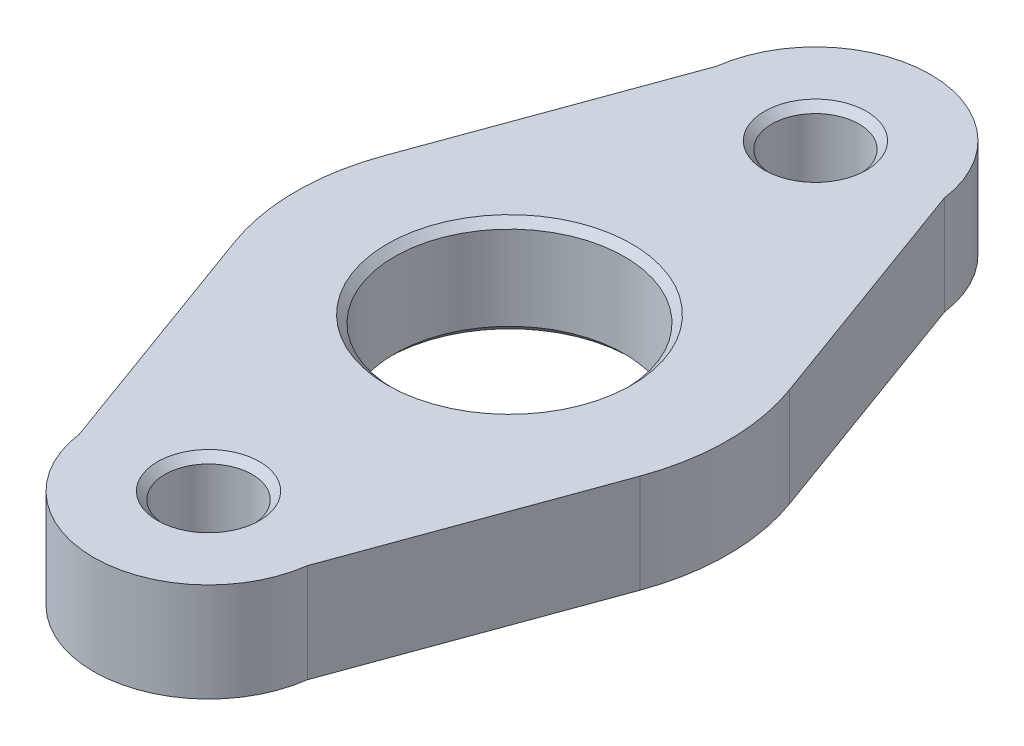
ISO-10303-21;
HEADER;
FILE_DESCRIPTION(('STEP AP214'),'2;1');
FILE_NAME('part.step','',(''),(''),'','','');
FILE_SCHEMA(('AUTOMOTIVE_DESIGN { 1 0 10303 214 1 1 1 1 }'));
ENDSEC;
DATA;
#1=APPLICATION_CONTEXT('core data for automotive mechanical design processes');
#2=APPLICATION_PROTOCOL_DEFINITION('international standard','automotive_design',2000,#1);
#3=PRODUCT_CONTEXT('',#1,'mechanical');
#4=PRODUCT('Part','Part','',(#3));
#5=PRODUCT_RELATED_PRODUCT_CATEGORY('part','',(#4));
#6=PRODUCT_DEFINITION_FORMATION('','',#4);
#7=PRODUCT_DEFINITION_CONTEXT('part definition',#1,'design');
#8=PRODUCT_DEFINITION('design','',#6,#7);
#9=PRODUCT_DEFINITION_SHAPE('','',#8);
#10=(LENGTH_UNIT() NAMED_UNIT(*) SI_UNIT(.MILLI.,.METRE.));
#11=(NAMED_UNIT(*) PLANE_ANGLE_UNIT() SI_UNIT($,.RADIAN.));
#12=(NAMED_UNIT(*) SI_UNIT($,.STERADIAN.) SOLID_ANGLE_UNIT());
#13=UNCERTAINTY_MEASURE_WITH_UNIT(LENGTH_MEASURE(1.E-05),#10,'distance_accuracy_value','');
#14=(GEOMETRIC_REPRESENTATION_CONTEXT(3) GLOBAL_UNCERTAINTY_ASSIGNED_CONTEXT((#13)) GLOBAL_UNIT_ASSIGNED_CONTEXT((#10,
#11,#12)) REPRESENTATION_CONTEXT('',''));
#15=CARTESIAN_POINT('',(0.,0.,0.));
#16=DIRECTION('',(0.,0.,1.));
#17=DIRECTION('',(1.,0.,0.));
#18=AXIS2_PLACEMENT_3D('',#15,#16,#17);
#19=CARTESIAN_POINT('',(95.6079158511101,80.772,0.));
#20=DIRECTION('',(0.,1.,0.));
#21=DIRECTION('',(0.,0.,1.));
#22=AXIS2_PLACEMENT_3D('',#19,#20,#21);
#23=PLANE('',#22);
#24=CARTESIAN_POINT('',(95.885,80.772,33.528));
#25=DIRECTION('',(0.,1.,0.));
#26=DIRECTION('',(0.,0.,1.));
#27=AXIS2_PLACEMENT_3D('',#24,#25,#26);
#28=CIRCLE('',#27,5.63879999999997);
#29=CARTESIAN_POINT('',(95.885,80.772,39.1668));
#30=VERTEX_POINT('',#29);
#31=EDGE_CURVE('E209',#30,#30,#28,.F.);
#32=ORIENTED_EDGE('',*,*,#31,.T.);
#33=EDGE_LOOP('',(#32));
#34=FACE_BOUND('',#33,.T.);
#35=CARTESIAN_POINT('',(95.885,80.772,-33.528));
#36=DIRECTION('',(0.,1.,0.));
#37=DIRECTION('',(0.,0.,1.));
#38=AXIS2_PLACEMENT_3D('',#35,#36,#37);
#39=CIRCLE('',#38,5.6388);
#40=CARTESIAN_POINT('',(95.885,80.772,-27.8892));
#41=VERTEX_POINT('',#40);
#42=EDGE_CURVE('E206',#41,#41,#39,.F.);
#43=ORIENTED_EDGE('',*,*,#42,.T.);
#44=EDGE_LOOP('',(#43));
#45=FACE_BOUND('',#44,.T.);
#46=CARTESIAN_POINT('',(95.6079158511101,80.772,0.));
#47=DIRECTION('',(0.,1.,0.));
#48=DIRECTION('',(0.,0.,1.));
#49=AXIS2_PLACEMENT_3D('',#46,#47,#48);
#50=CIRCLE('',#49,13.5128);
#51=CARTESIAN_POINT('',(95.6079158511101,80.772,13.5128));
#52=VERTEX_POINT('',#51);
#53=EDGE_CURVE('E203',#52,#52,#50,.F.);
#54=ORIENTED_EDGE('',*,*,#53,.T.);
#55=EDGE_LOOP('',(#54));
#56=FACE_BOUND('',#55,.T.);
#57=CARTESIAN_POINT('',(95.6079158511101,80.772,0.));
#58=DIRECTION('',(0.,1.,0.));
#59=DIRECTION('',(0.,0.,1.));
#60=AXIS2_PLACEMENT_3D('',#57,#58,#59);
#61=CIRCLE('',#60,24.13);
#62=CARTESIAN_POINT('',(118.282698790674,80.772,8.25294605844834));
#63=VERTEX_POINT('',#62);
#64=CARTESIAN_POINT('',(118.282698790674,80.772,-8.25294605844833));
#65=VERTEX_POINT('',#64);
#66=EDGE_CURVE('E173',#63,#65,#61,.T.);
#67=ORIENTED_EDGE('',*,*,#66,.T.);
#68=DIRECTION('',(-0.342020143325663,0.,-0.939692620785911));
#69=VECTOR('',#68,1.);
#70=CARTESIAN_POINT('',(118.282698790674,80.772,-8.25294605844833));
#71=LINE('',#70,#69);
#72=CARTESIAN_POINT('',(108.474274458966,80.772,-35.2013704302452));
#73=VERTEX_POINT('',#72);
#74=EDGE_CURVE('E123',#65,#73,#71,.T.);
#75=ORIENTED_EDGE('',*,*,#74,.T.);
#76=CARTESIAN_POINT('',(95.885,80.772,-33.528));
#77=DIRECTION('',(0.,1.,0.));
#78=DIRECTION('',(0.,0.,1.));
#79=AXIS2_PLACEMENT_3D('',#76,#77,#78);
#80=CIRCLE('',#79,12.7);
#81=CARTESIAN_POINT('',(83.2957255410337,80.772,-35.2013704302452));
#82=VERTEX_POINT('',#81);
#83=EDGE_CURVE('E314',#73,#82,#80,.T.);
#84=ORIENTED_EDGE('',*,*,#83,.T.);
#85=DIRECTION('',(-0.342020143325663,0.,0.93969262078591));
#86=VECTOR('',#85,1.);
#87=CARTESIAN_POINT('',(83.2957255410337,80.772,-35.2013704302452));
#88=LINE('',#87,#86);
#89=CARTESIAN_POINT('',(73.4873012093259,80.772,-8.25294605844835));
#90=VERTEX_POINT('',#89);
#91=EDGE_CURVE('E318',#82,#90,#88,.T.);
#92=ORIENTED_EDGE('',*,*,#91,.T.);
#93=CARTESIAN_POINT('',(96.1620841488899,80.772,0.));
#94=DIRECTION('',(0.,1.,0.));
#95=DIRECTION('',(0.,0.,1.));
#96=AXIS2_PLACEMENT_3D('',#93,#94,#95);
#97=CIRCLE('',#96,24.13);
#98=CARTESIAN_POINT('',(73.4873012093259,80.772,8.25294605844834));
#99=VERTEX_POINT('',#98);
#100=EDGE_CURVE('E141',#90,#99,#97,.T.);
#101=ORIENTED_EDGE('',*,*,#100,.T.);
#102=DIRECTION('',(0.342020143325663,0.,0.93969262078591));
#103=VECTOR('',#102,1.);
#104=CARTESIAN_POINT('',(73.4873012093259,80.772,8.25294605844834));
#105=LINE('',#104,#103);
#106=CARTESIAN_POINT('',(83.2957255410337,80.772,35.2013704302452));
#107=VERTEX_POINT('',#106);
#108=EDGE_CURVE('E136',#99,#107,#105,.T.);
#109=ORIENTED_EDGE('',*,*,#108,.T.);
#110=CARTESIAN_POINT('',(95.885,80.772,33.528));
#111=DIRECTION('',(0.,1.,0.));
#112=DIRECTION('',(0.,0.,1.));
#113=AXIS2_PLACEMENT_3D('',#110,#111,#112);
#114=CIRCLE('',#113,12.7);
#115=CARTESIAN_POINT('',(108.474274458966,80.772,35.2013704302452));
#116=VERTEX_POINT('',#115);
#117=EDGE_CURVE('E139',#107,#116,#114,.T.);
#118=ORIENTED_EDGE('',*,*,#117,.T.);
#119=DIRECTION('',(0.342020143325663,0.,-0.939692620785911));
#120=VECTOR('',#119,1.);
#121=CARTESIAN_POINT('',(108.474274458966,80.772,35.2013704302452));
#122=LINE('',#121,#120);
#123=EDGE_CURVE('E79',#116,#63,#122,.T.);
#124=ORIENTED_EDGE('',*,*,#123,.T.);
#125=EDGE_LOOP('',(#67,#75,#84,#92,#101,#109,#118,#124));
#126=FACE_BOUND('',#125,.T.);
#127=ADVANCED_FACE('F62',(#34,#45,#56,#126),#23,.T.);
#128=CARTESIAN_POINT('',(95.6079158511101,69.85,0.));
#129=DIRECTION('',(0.,1.,0.));
#130=DIRECTION('',(0.,0.,1.));
#131=AXIS2_PLACEMENT_3D('',#128,#129,#130);
#132=PLANE('',#131);
#133=CARTESIAN_POINT('',(95.885,69.85,33.528));
#134=DIRECTION('',(0.,1.,0.));
#135=DIRECTION('',(0.,0.,1.));
#136=AXIS2_PLACEMENT_3D('',#133,#134,#135);
#137=CIRCLE('',#136,5.63879999999999);
#138=CARTESIAN_POINT('',(95.885,69.85,39.1668));
#139=VERTEX_POINT('',#138);
#140=EDGE_CURVE('E194',#139,#139,#137,.T.);
#141=ORIENTED_EDGE('',*,*,#140,.T.);
#142=EDGE_LOOP('',(#141));
#143=FACE_BOUND('',#142,.T.);
#144=CARTESIAN_POINT('',(95.885,69.85,-33.528));
#145=DIRECTION('',(0.,1.,0.));
#146=DIRECTION('',(0.,0.,1.));
#147=AXIS2_PLACEMENT_3D('',#144,#145,#146);
#148=CIRCLE('',#147,5.63879999999997);
#149=CARTESIAN_POINT('',(95.885,69.85,-27.8892));
#150=VERTEX_POINT('',#149);
#151=EDGE_CURVE('E191',#150,#150,#148,.T.);
#152=ORIENTED_EDGE('',*,*,#151,.T.);
#153=EDGE_LOOP('',(#152));
#154=FACE_BOUND('',#153,.T.);
#155=CARTESIAN_POINT('',(95.6079158511101,69.85,0.));
#156=DIRECTION('',(0.,1.,0.));
#157=DIRECTION('',(0.,0.,1.));
#158=AXIS2_PLACEMENT_3D('',#155,#156,#157);
#159=CIRCLE('',#158,13.5128);
#160=CARTESIAN_POINT('',(95.6079158511101,69.85,13.5128));
#161=VERTEX_POINT('',#160);
#162=EDGE_CURVE('E188',#161,#161,#159,.T.);
#163=ORIENTED_EDGE('',*,*,#162,.T.);
#164=EDGE_LOOP('',(#163));
#165=FACE_BOUND('',#164,.T.);
#166=CARTESIAN_POINT('',(95.6079158511101,69.85,0.));
#167=DIRECTION('',(0.,1.,0.));
#168=DIRECTION('',(0.,0.,1.));
#169=AXIS2_PLACEMENT_3D('',#166,#167,#168);
#170=CIRCLE('',#169,24.13);
#171=CARTESIAN_POINT('',(118.282698790674,69.85,8.25294605844834));
#172=VERTEX_POINT('',#171);
#173=CARTESIAN_POINT('',(118.282698790674,69.85,-8.25294605844833));
#174=VERTEX_POINT('',#173);
#175=EDGE_CURVE('E159',#172,#174,#170,.T.);
#176=ORIENTED_EDGE('',*,*,#175,.F.);
#177=DIRECTION('',(0.342020143325663,0.,-0.939692620785911));
#178=VECTOR('',#177,1.);
#179=CARTESIAN_POINT('',(108.474274458966,69.85,35.2013704302452));
#180=LINE('',#179,#178);
#181=CARTESIAN_POINT('',(108.474274458966,69.85,35.2013704302452));
#182=VERTEX_POINT('',#181);
#183=EDGE_CURVE('E114',#182,#172,#180,.T.);
#184=ORIENTED_EDGE('',*,*,#183,.F.);
#185=CARTESIAN_POINT('',(95.885,69.85,33.528));
#186=DIRECTION('',(0.,1.,0.));
#187=DIRECTION('',(0.,0.,1.));
#188=AXIS2_PLACEMENT_3D('',#185,#186,#187);
#189=CIRCLE('',#188,12.7);
#190=CARTESIAN_POINT('',(83.2957255410337,69.85,35.2013704302452));
#191=VERTEX_POINT('',#190);
#192=EDGE_CURVE('E108',#191,#182,#189,.T.);
#193=ORIENTED_EDGE('',*,*,#192,.F.);
#194=DIRECTION('',(0.342020143325663,0.,0.93969262078591));
#195=VECTOR('',#194,1.);
#196=CARTESIAN_POINT('',(73.4873012093259,69.85,8.25294605844834));
#197=LINE('',#196,#195);
#198=CARTESIAN_POINT('',(73.4873012093259,69.85,8.25294605844834));
#199=VERTEX_POINT('',#198);
#200=EDGE_CURVE('E149',#199,#191,#197,.T.);
#201=ORIENTED_EDGE('',*,*,#200,.F.);
#202=CARTESIAN_POINT('',(96.1620841488899,69.85,0.));
#203=DIRECTION('',(0.,1.,0.));
#204=DIRECTION('',(0.,0.,1.));
#205=AXIS2_PLACEMENT_3D('',#202,#203,#204);
#206=CIRCLE('',#205,24.13);
#207=CARTESIAN_POINT('',(73.4873012093259,69.85,-8.25294605844835));
#208=VERTEX_POINT('',#207);
#209=EDGE_CURVE('E168',#208,#199,#206,.T.);
#210=ORIENTED_EDGE('',*,*,#209,.F.);
#211=DIRECTION('',(-0.342020143325663,0.,0.93969262078591));
#212=VECTOR('',#211,1.);
#213=CARTESIAN_POINT('',(83.2957255410337,69.85,-35.2013704302452));
#214=LINE('',#213,#212);
#215=CARTESIAN_POINT('',(83.2957255410337,69.85,-35.2013704302452));
#216=VERTEX_POINT('',#215);
#217=EDGE_CURVE('E166',#216,#208,#214,.T.);
#218=ORIENTED_EDGE('',*,*,#217,.F.);
#219=CARTESIAN_POINT('',(95.885,69.85,-33.528));
#220=DIRECTION('',(0.,1.,0.));
#221=DIRECTION('',(0.,0.,1.));
#222=AXIS2_PLACEMENT_3D('',#219,#220,#221);
#223=CIRCLE('',#222,12.7);
#224=CARTESIAN_POINT('',(108.474274458966,69.85,-35.2013704302452));
#225=VERTEX_POINT('',#224);
#226=EDGE_CURVE('E164',#225,#216,#223,.T.);
#227=ORIENTED_EDGE('',*,*,#226,.F.);
#228=DIRECTION('',(-0.342020143325663,0.,-0.939692620785911));
#229=VECTOR('',#228,1.);
#230=CARTESIAN_POINT('',(118.282698790674,69.85,-8.25294605844833));
#231=LINE('',#230,#229);
#232=EDGE_CURVE('E162',#174,#225,#231,.T.);
#233=ORIENTED_EDGE('',*,*,#232,.F.);
#234=EDGE_LOOP('',(#176,#184,#193,#201,#210,#218,#227,#233));
#235=FACE_BOUND('',#234,.T.);
#236=ADVANCED_FACE('F232',(#143,#154,#165,#235),#132,.F.);
#237=CARTESIAN_POINT('',(95.6079158511101,80.772,0.));
#238=DIRECTION('',(0.,-1.,0.));
#239=DIRECTION('',(0.,0.,-1.));
#240=AXIS2_PLACEMENT_3D('',#237,#238,#239);
#241=CYLINDRICAL_SURFACE('',#240,24.13);
#242=ORIENTED_EDGE('',*,*,#175,.T.);
#243=DIRECTION('',(0.,-1.,0.));
#244=VECTOR('',#243,1.);
#245=CARTESIAN_POINT('',(118.282698790674,80.772,-8.25294605844833));
#246=LINE('',#245,#244);
#247=EDGE_CURVE('E186',#65,#174,#246,.T.);
#248=ORIENTED_EDGE('',*,*,#247,.F.);
#249=ORIENTED_EDGE('',*,*,#66,.F.);
#250=DIRECTION('',(0.,-1.,0.));
#251=VECTOR('',#250,1.);
#252=CARTESIAN_POINT('',(118.282698790674,80.772,8.25294605844834));
#253=LINE('',#252,#251);
#254=EDGE_CURVE('E155',#63,#172,#253,.T.);
#255=ORIENTED_EDGE('',*,*,#254,.T.);
#256=EDGE_LOOP('',(#242,#248,#249,#255));
#257=FACE_BOUND('',#256,.T.);
#258=ADVANCED_FACE('F239',(#257),#241,.T.);
#259=CARTESIAN_POINT('',(118.282698790674,80.772,-8.25294605844833));
#260=DIRECTION('',(-0.939692620785911,0.,0.342020143325662));
#261=DIRECTION('',(0.342020143325662,0.,0.939692620785911));
#262=AXIS2_PLACEMENT_3D('',#259,#260,#261);
#263=PLANE('',#262);
#264=ORIENTED_EDGE('',*,*,#232,.T.);
#265=DIRECTION('',(0.,-1.,0.));
#266=VECTOR('',#265,1.);
#267=CARTESIAN_POINT('',(108.474274458966,80.772,-35.2013704302452));
#268=LINE('',#267,#266);
#269=EDGE_CURVE('E183',#73,#225,#268,.T.);
#270=ORIENTED_EDGE('',*,*,#269,.F.);
#271=ORIENTED_EDGE('',*,*,#74,.F.);
#272=ORIENTED_EDGE('',*,*,#247,.T.);
#273=EDGE_LOOP('',(#264,#270,#271,#272));
#274=FACE_BOUND('',#273,.T.);
#275=ADVANCED_FACE('F264',(#274),#263,.F.);
#276=CARTESIAN_POINT('',(95.885,80.772,-33.528));
#277=DIRECTION('',(0.,-1.,0.));
#278=DIRECTION('',(0.,0.,-1.));
#279=AXIS2_PLACEMENT_3D('',#276,#277,#278);
#280=CYLINDRICAL_SURFACE('',#279,12.7);
#281=ORIENTED_EDGE('',*,*,#226,.T.);
#282=DIRECTION('',(0.,-1.,0.));
#283=VECTOR('',#282,1.);
#284=CARTESIAN_POINT('',(83.2957255410337,80.772,-35.2013704302452));
#285=LINE('',#284,#283);
#286=EDGE_CURVE('E180',#82,#216,#285,.T.);
#287=ORIENTED_EDGE('',*,*,#286,.F.);
#288=ORIENTED_EDGE('',*,*,#83,.F.);
#289=ORIENTED_EDGE('',*,*,#269,.T.);
#290=EDGE_LOOP('',(#281,#287,#288,#289));
#291=FACE_BOUND('',#290,.T.);
#292=ADVANCED_FACE('F260',(#291),#280,.T.);
#293=CARTESIAN_POINT('',(83.2957255410337,80.772,-35.2013704302452));
#294=DIRECTION('',(0.93969262078591,0.,0.342020143325663));
#295=DIRECTION('',(0.342020143325663,0.,-0.939692620785911));
#296=AXIS2_PLACEMENT_3D('',#293,#294,#295);
#297=PLANE('',#296);
#298=ORIENTED_EDGE('',*,*,#217,.T.);
#299=DIRECTION('',(0.,-1.,0.));
#300=VECTOR('',#299,1.);
#301=CARTESIAN_POINT('',(73.4873012093259,80.772,-8.25294605844835));
#302=LINE('',#301,#300);
#303=EDGE_CURVE('E177',#90,#208,#302,.T.);
#304=ORIENTED_EDGE('',*,*,#303,.F.);
#305=ORIENTED_EDGE('',*,*,#91,.F.);
#306=ORIENTED_EDGE('',*,*,#286,.T.);
#307=EDGE_LOOP('',(#298,#304,#305,#306));
#308=FACE_BOUND('',#307,.T.);
#309=ADVANCED_FACE('F256',(#308),#297,.F.);
#310=CARTESIAN_POINT('',(96.1620841488899,80.772,0.));
#311=DIRECTION('',(0.,-1.,0.));
#312=DIRECTION('',(0.,0.,-1.));
#313=AXIS2_PLACEMENT_3D('',#310,#311,#312);
#314=CYLINDRICAL_SURFACE('',#313,24.13);
#315=ORIENTED_EDGE('',*,*,#209,.T.);
#316=DIRECTION('',(0.,-1.,0.));
#317=VECTOR('',#316,1.);
#318=CARTESIAN_POINT('',(73.4873012093259,80.772,8.25294605844834));
#319=LINE('',#318,#317);
#320=EDGE_CURVE('E150',#99,#199,#319,.T.);
#321=ORIENTED_EDGE('',*,*,#320,.F.);
#322=ORIENTED_EDGE('',*,*,#100,.F.);
#323=ORIENTED_EDGE('',*,*,#303,.T.);
#324=EDGE_LOOP('',(#315,#321,#322,#323));
#325=FACE_BOUND('',#324,.T.);
#326=ADVANCED_FACE('F253',(#325),#314,.T.);
#327=CARTESIAN_POINT('',(73.4873012093259,80.772,8.25294605844834));
#328=DIRECTION('',(0.93969262078591,0.,-0.342020143325663));
#329=DIRECTION('',(-0.342020143325663,0.,-0.939692620785911));
#330=AXIS2_PLACEMENT_3D('',#327,#328,#329);
#331=PLANE('',#330);
#332=ORIENTED_EDGE('',*,*,#200,.T.);
#333=DIRECTION('',(0.,-1.,0.));
#334=VECTOR('',#333,1.);
#335=CARTESIAN_POINT('',(83.2957255410337,80.772,35.2013704302452));
#336=LINE('',#335,#334);
#337=EDGE_CURVE('E146',#107,#191,#336,.T.);
#338=ORIENTED_EDGE('',*,*,#337,.F.);
#339=ORIENTED_EDGE('',*,*,#108,.F.);
#340=ORIENTED_EDGE('',*,*,#320,.T.);
#341=EDGE_LOOP('',(#332,#338,#339,#340));
#342=FACE_BOUND('',#341,.T.);
#343=ADVANCED_FACE('F147',(#342),#331,.F.);
#344=CARTESIAN_POINT('',(95.885,80.772,33.528));
#345=DIRECTION('',(0.,-1.,0.));
#346=DIRECTION('',(0.,0.,-1.));
#347=AXIS2_PLACEMENT_3D('',#344,#345,#346);
#348=CYLINDRICAL_SURFACE('',#347,12.7);
#349=ORIENTED_EDGE('',*,*,#192,.T.);
#350=DIRECTION('',(0.,-1.,0.));
#351=VECTOR('',#350,1.);
#352=CARTESIAN_POINT('',(108.474274458966,80.772,35.2013704302452));
#353=LINE('',#352,#351);
#354=EDGE_CURVE('E151',#116,#182,#353,.T.);
#355=ORIENTED_EDGE('',*,*,#354,.F.);
#356=ORIENTED_EDGE('',*,*,#117,.F.);
#357=ORIENTED_EDGE('',*,*,#337,.T.);
#358=EDGE_LOOP('',(#349,#355,#356,#357));
#359=FACE_BOUND('',#358,.T.);
#360=ADVANCED_FACE('F153',(#359),#348,.T.);
#361=CARTESIAN_POINT('',(108.474274458966,80.772,35.2013704302452));
#362=DIRECTION('',(-0.939692620785911,0.,-0.342020143325663));
#363=DIRECTION('',(-0.342020143325663,0.,0.939692620785911));
#364=AXIS2_PLACEMENT_3D('',#361,#362,#363);
#365=PLANE('',#364);
#366=ORIENTED_EDGE('',*,*,#183,.T.);
#367=ORIENTED_EDGE('',*,*,#254,.F.);
#368=ORIENTED_EDGE('',*,*,#123,.F.);
#369=ORIENTED_EDGE('',*,*,#354,.T.);
#370=EDGE_LOOP('',(#366,#367,#368,#369));
#371=FACE_BOUND('',#370,.T.);
#372=ADVANCED_FACE('F246',(#371),#365,.F.);
#373=CARTESIAN_POINT('',(95.6079158511101,80.772,0.));
#374=DIRECTION('',(0.,-1.,0.));
#375=DIRECTION('',(0.,0.,-1.));
#376=AXIS2_PLACEMENT_3D('',#373,#374,#375);
#377=CYLINDRICAL_SURFACE('',#376,12.7);
#378=CARTESIAN_POINT('',(95.6079158511101,70.6628,0.));
#379=DIRECTION('',(0.,1.,0.));
#380=DIRECTION('',(0.,0.,1.));
#381=AXIS2_PLACEMENT_3D('',#378,#379,#380);
#382=CIRCLE('',#381,12.7);
#383=CARTESIAN_POINT('',(95.6079158511101,70.6628,12.7));
#384=VERTEX_POINT('',#383);
#385=EDGE_CURVE('E12',#384,#384,#382,.F.);
#386=ORIENTED_EDGE('',*,*,#385,.T.);
#387=EDGE_LOOP('',(#386));
#388=FACE_BOUND('',#387,.T.);
#389=CARTESIAN_POINT('',(95.6079158511101,79.9592,0.));
#390=DIRECTION('',(0.,1.,0.));
#391=DIRECTION('',(0.,0.,1.));
#392=AXIS2_PLACEMENT_3D('',#389,#390,#391);
#393=CIRCLE('',#392,12.7);
#394=CARTESIAN_POINT('',(95.6079158511101,79.9592,12.7));
#395=VERTEX_POINT('',#394);
#396=EDGE_CURVE('E71',#395,#395,#393,.T.);
#397=ORIENTED_EDGE('',*,*,#396,.T.);
#398=EDGE_LOOP('',(#397));
#399=FACE_BOUND('',#398,.T.);
#400=ADVANCED_FACE('F220',(#388,#399),#377,.F.);
#401=CARTESIAN_POINT('',(95.885,80.772,-33.528));
#402=DIRECTION('',(0.,-1.,0.));
#403=DIRECTION('',(0.,0.,-1.));
#404=AXIS2_PLACEMENT_3D('',#401,#402,#403);
#405=CYLINDRICAL_SURFACE('',#404,4.82599999999999);
#406=CARTESIAN_POINT('',(95.885,70.6628,-33.528));
#407=DIRECTION('',(0.,1.,0.));
#408=DIRECTION('',(0.,0.,1.));
#409=AXIS2_PLACEMENT_3D('',#406,#407,#408);
#410=CIRCLE('',#409,4.82599999999999);
#411=CARTESIAN_POINT('',(95.885,70.6628,-28.702));
#412=VERTEX_POINT('',#411);
#413=EDGE_CURVE('E215',#412,#412,#410,.F.);
#414=ORIENTED_EDGE('',*,*,#413,.T.);
#415=EDGE_LOOP('',(#414));
#416=FACE_BOUND('',#415,.T.);
#417=CARTESIAN_POINT('',(95.885,79.9592,-33.528));
#418=DIRECTION('',(0.,1.,0.));
#419=DIRECTION('',(0.,0.,1.));
#420=AXIS2_PLACEMENT_3D('',#417,#418,#419);
#421=CIRCLE('',#420,4.82599999999999);
#422=CARTESIAN_POINT('',(95.885,79.9592,-28.702));
#423=VERTEX_POINT('',#422);
#424=EDGE_CURVE('E212',#423,#423,#421,.T.);
#425=ORIENTED_EDGE('',*,*,#424,.T.);
#426=EDGE_LOOP('',(#425));
#427=FACE_BOUND('',#426,.T.);
#428=ADVANCED_FACE('F292',(#416,#427),#405,.F.);
#429=CARTESIAN_POINT('',(95.885,80.772,33.528));
#430=DIRECTION('',(0.,-1.,0.));
#431=DIRECTION('',(0.,0.,-1.));
#432=AXIS2_PLACEMENT_3D('',#429,#430,#431);
#433=CYLINDRICAL_SURFACE('',#432,4.82599999999999);
#434=CARTESIAN_POINT('',(95.885,70.6628,33.528));
#435=DIRECTION('',(0.,1.,0.));
#436=DIRECTION('',(0.,0.,1.));
#437=AXIS2_PLACEMENT_3D('',#434,#435,#436);
#438=CIRCLE('',#437,4.82599999999999);
#439=CARTESIAN_POINT('',(95.885,70.6628,38.354));
#440=VERTEX_POINT('',#439);
#441=EDGE_CURVE('E200',#440,#440,#438,.F.);
#442=ORIENTED_EDGE('',*,*,#441,.T.);
#443=EDGE_LOOP('',(#442));
#444=FACE_BOUND('',#443,.T.);
#445=CARTESIAN_POINT('',(95.885,79.9592,33.528));
#446=DIRECTION('',(0.,1.,0.));
#447=DIRECTION('',(0.,0.,1.));
#448=AXIS2_PLACEMENT_3D('',#445,#446,#447);
#449=CIRCLE('',#448,4.82599999999999);
#450=CARTESIAN_POINT('',(95.885,79.9592,38.354));
#451=VERTEX_POINT('',#450);
#452=EDGE_CURVE('E197',#451,#451,#449,.T.);
#453=ORIENTED_EDGE('',*,*,#452,.T.);
#454=EDGE_LOOP('',(#453));
#455=FACE_BOUND('',#454,.T.);
#456=ADVANCED_FACE('F275',(#444,#455),#433,.F.);
#457=CARTESIAN_POINT('',(95.885,69.85,33.528));
#458=DIRECTION('',(0.,-1.,0.));
#459=DIRECTION('',(0.,0.,-1.));
#460=AXIS2_PLACEMENT_3D('',#457,#458,#459);
#461=CONICAL_SURFACE('',#460,5.63879999999999,0.785398163397445);
#462=ORIENTED_EDGE('',*,*,#441,.F.);
#463=EDGE_LOOP('',(#462));
#464=FACE_BOUND('',#463,.T.);
#465=ORIENTED_EDGE('',*,*,#140,.F.);
#466=EDGE_LOOP('',(#465));
#467=FACE_BOUND('',#466,.T.);
#468=ADVANCED_FACE('F271',(#464,#467),#461,.F.);
#469=CARTESIAN_POINT('',(95.885,79.9592,33.528));
#470=DIRECTION('',(0.,1.,0.));
#471=DIRECTION('',(0.,0.,1.));
#472=AXIS2_PLACEMENT_3D('',#469,#470,#471);
#473=CONICAL_SURFACE('',#472,4.82599999999999,0.785398163397445);
#474=ORIENTED_EDGE('',*,*,#31,.F.);
#475=EDGE_LOOP('',(#474));
#476=FACE_BOUND('',#475,.T.);
#477=ORIENTED_EDGE('',*,*,#452,.F.);
#478=EDGE_LOOP('',(#477));
#479=FACE_BOUND('',#478,.T.);
#480=ADVANCED_FACE('F274',(#476,#479),#473,.F.);
#481=CARTESIAN_POINT('',(95.885,69.85,-33.528));
#482=DIRECTION('',(0.,-1.,0.));
#483=DIRECTION('',(0.,0.,-1.));
#484=AXIS2_PLACEMENT_3D('',#481,#482,#483);
#485=CONICAL_SURFACE('',#484,5.63879999999997,0.785398163397445);
#486=ORIENTED_EDGE('',*,*,#413,.F.);
#487=EDGE_LOOP('',(#486));
#488=FACE_BOUND('',#487,.T.);
#489=ORIENTED_EDGE('',*,*,#151,.F.);
#490=EDGE_LOOP('',(#489));
#491=FACE_BOUND('',#490,.T.);
#492=ADVANCED_FACE('F279',(#488,#491),#485,.F.);
#493=CARTESIAN_POINT('',(95.885,79.9592,-33.528));
#494=DIRECTION('',(0.,1.,0.));
#495=DIRECTION('',(0.,0.,1.));
#496=AXIS2_PLACEMENT_3D('',#493,#494,#495);
#497=CONICAL_SURFACE('',#496,4.82599999999999,0.785398163397445);
#498=ORIENTED_EDGE('',*,*,#42,.F.);
#499=EDGE_LOOP('',(#498));
#500=FACE_BOUND('',#499,.T.);
#501=ORIENTED_EDGE('',*,*,#424,.F.);
#502=EDGE_LOOP('',(#501));
#503=FACE_BOUND('',#502,.T.);
#504=ADVANCED_FACE('F228',(#500,#503),#497,.F.);
#505=CARTESIAN_POINT('',(95.6079158511101,69.85,0.));
#506=DIRECTION('',(0.,-1.,0.));
#507=DIRECTION('',(0.,0.,-1.));
#508=AXIS2_PLACEMENT_3D('',#505,#506,#507);
#509=CONICAL_SURFACE('',#508,13.5128,0.78539816339745);
#510=ORIENTED_EDGE('',*,*,#385,.F.);
#511=EDGE_LOOP('',(#510));
#512=FACE_BOUND('',#511,.T.);
#513=ORIENTED_EDGE('',*,*,#162,.F.);
#514=EDGE_LOOP('',(#513));
#515=FACE_BOUND('',#514,.T.);
#516=ADVANCED_FACE('F223',(#512,#515),#509,.F.);
#517=CARTESIAN_POINT('',(95.6079158511101,79.9592,0.));
#518=DIRECTION('',(0.,1.,0.));
#519=DIRECTION('',(0.,0.,1.));
#520=AXIS2_PLACEMENT_3D('',#517,#518,#519);
#521=CONICAL_SURFACE('',#520,12.7,0.78539816339744);
#522=ORIENTED_EDGE('',*,*,#53,.F.);
#523=EDGE_LOOP('',(#522));
#524=FACE_BOUND('',#523,.T.);
#525=ORIENTED_EDGE('',*,*,#396,.F.);
#526=EDGE_LOOP('',(#525));
#527=FACE_BOUND('',#526,.T.);
#528=ADVANCED_FACE('F64',(#524,#527),#521,.F.);
#529=CLOSED_SHELL('',(#127,#236,#258,#275,#292,#309,#326,#343,#360,#372,#400,#428,#456,#468,
#480,#492,#504,#516,#528));
#530=MANIFOLD_SOLID_BREP('B2',#529);
#531=ADVANCED_BREP_SHAPE_REPRESENTATION('',(#18,#530),#14);
#532=SHAPE_DEFINITION_REPRESENTATION(#9,#531);
ENDSEC;
END-ISO-10303-21;
